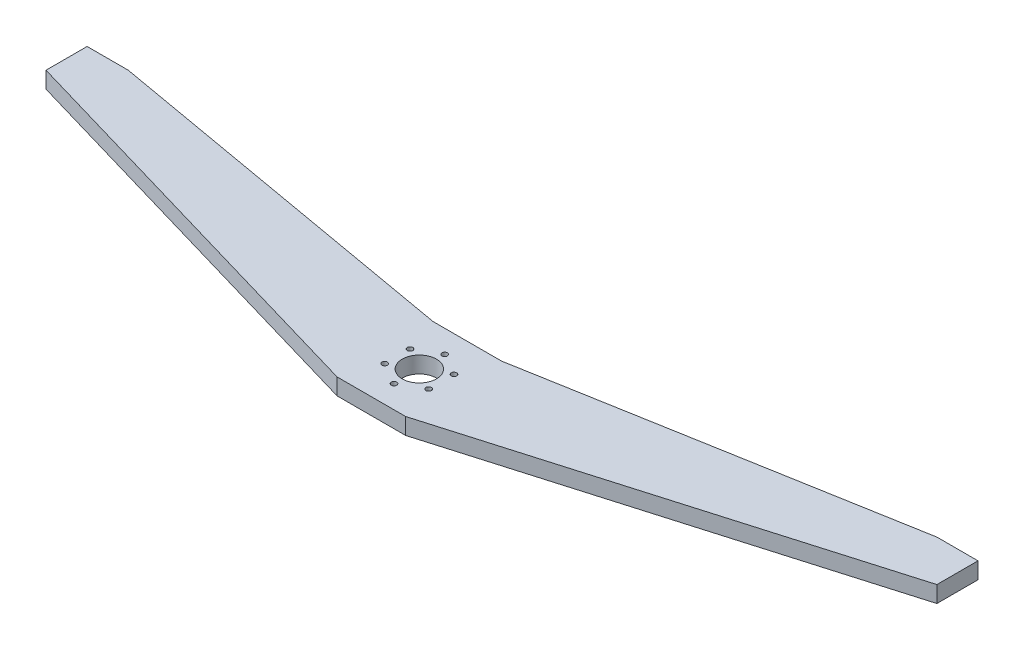
ISO-10303-21;
HEADER;
FILE_DESCRIPTION(('STEP AP214'),'2;1');
FILE_NAME('part.step','',(''),(''),'','','');
FILE_SCHEMA(('AUTOMOTIVE_DESIGN { 1 0 10303 214 1 1 1 1 }'));
ENDSEC;
DATA;
#1=APPLICATION_CONTEXT('core data for automotive mechanical design processes');
#2=APPLICATION_PROTOCOL_DEFINITION('international standard','automotive_design',2000,#1);
#3=PRODUCT_CONTEXT('',#1,'mechanical');
#4=PRODUCT('Part','Part','',(#3));
#5=PRODUCT_RELATED_PRODUCT_CATEGORY('part','',(#4));
#6=PRODUCT_DEFINITION_FORMATION('','',#4);
#7=PRODUCT_DEFINITION_CONTEXT('part definition',#1,'design');
#8=PRODUCT_DEFINITION('design','',#6,#7);
#9=PRODUCT_DEFINITION_SHAPE('','',#8);
#10=(LENGTH_UNIT() NAMED_UNIT(*) SI_UNIT(.MILLI.,.METRE.));
#11=(NAMED_UNIT(*) PLANE_ANGLE_UNIT() SI_UNIT($,.RADIAN.));
#12=(NAMED_UNIT(*) SI_UNIT($,.STERADIAN.) SOLID_ANGLE_UNIT());
#13=UNCERTAINTY_MEASURE_WITH_UNIT(LENGTH_MEASURE(1.E-05),#10,'distance_accuracy_value','');
#14=(GEOMETRIC_REPRESENTATION_CONTEXT(3) GLOBAL_UNCERTAINTY_ASSIGNED_CONTEXT((#13)) GLOBAL_UNIT_ASSIGNED_CONTEXT((#10,
#11,#12)) REPRESENTATION_CONTEXT('',''));
#15=CARTESIAN_POINT('',(0.,0.,0.));
#16=DIRECTION('',(0.,0.,1.));
#17=DIRECTION('',(1.,0.,0.));
#18=AXIS2_PLACEMENT_3D('',#15,#16,#17);
#19=CARTESIAN_POINT('',(-318.206861599198,12.,-87.6082847912839));
#20=DIRECTION('',(1.,0.,0.));
#21=DIRECTION('',(0.,0.,-1.));
#22=AXIS2_PLACEMENT_3D('',#19,#20,#21);
#23=PLANE('',#22);
#24=DIRECTION('',(0.,0.,1.));
#25=VECTOR('',#24,1.);
#26=CARTESIAN_POINT('',(-318.206861599198,0.,-87.6082847912839));
#27=LINE('',#26,#25);
#28=CARTESIAN_POINT('',(-318.206861599198,0.,-117.608284791284));
#29=VERTEX_POINT('',#28);
#30=CARTESIAN_POINT('',(-318.206861599198,0.,-87.6082847912839));
#31=VERTEX_POINT('',#30);
#32=EDGE_CURVE('E144',#29,#31,#27,.T.);
#33=ORIENTED_EDGE('',*,*,#32,.T.);
#34=DIRECTION('',(0.,-1.,0.));
#35=VECTOR('',#34,1.);
#36=CARTESIAN_POINT('',(-318.206861599198,12.,-87.6082847912839));
#37=LINE('',#36,#35);
#38=CARTESIAN_POINT('',(-318.206861599198,12.,-87.6082847912839));
#39=VERTEX_POINT('',#38);
#40=EDGE_CURVE('E11',#39,#31,#37,.T.);
#41=ORIENTED_EDGE('',*,*,#40,.F.);
#42=DIRECTION('',(0.,0.,1.));
#43=VECTOR('',#42,1.);
#44=CARTESIAN_POINT('',(-318.206861599198,12.,-87.6082847912839));
#45=LINE('',#44,#43);
#46=CARTESIAN_POINT('',(-318.206861599198,12.,-117.608284791284));
#47=VERTEX_POINT('',#46);
#48=EDGE_CURVE('E162',#47,#39,#45,.T.);
#49=ORIENTED_EDGE('',*,*,#48,.F.);
#50=DIRECTION('',(0.,-1.,0.));
#51=VECTOR('',#50,1.);
#52=CARTESIAN_POINT('',(-318.206861599198,12.,-117.608284791284));
#53=LINE('',#52,#51);
#54=EDGE_CURVE('E140',#47,#29,#53,.T.);
#55=ORIENTED_EDGE('',*,*,#54,.T.);
#56=EDGE_LOOP('',(#33,#41,#49,#55));
#57=FACE_BOUND('',#56,.T.);
#58=ADVANCED_FACE('F34',(#57),#23,.F.);
#59=CARTESIAN_POINT('',(-318.206861599198,12.,-87.6082847912839));
#60=DIRECTION('',(0.280319298356245,0.,-0.959906813690299));
#61=DIRECTION('',(-0.959906813690299,0.,-0.280319298356245));
#62=AXIS2_PLACEMENT_3D('',#59,#60,#61);
#63=PLANE('',#62);
#64=DIRECTION('',(0.959906813690299,0.,0.280319298356245));
#65=VECTOR('',#64,1.);
#66=CARTESIAN_POINT('',(-318.206861599198,0.,-87.6082847912839));
#67=LINE('',#66,#65);
#68=CARTESIAN_POINT('',(-18.2068615991978,0.,0.));
#69=VERTEX_POINT('',#68);
#70=EDGE_CURVE('E147',#31,#69,#67,.T.);
#71=ORIENTED_EDGE('',*,*,#70,.T.);
#72=DIRECTION('',(0.,-1.,0.));
#73=VECTOR('',#72,1.);
#74=CARTESIAN_POINT('',(-18.2068615991978,12.,0.));
#75=LINE('',#74,#73);
#76=CARTESIAN_POINT('',(-18.2068615991978,12.,0.));
#77=VERTEX_POINT('',#76);
#78=EDGE_CURVE('E43',#77,#69,#75,.T.);
#79=ORIENTED_EDGE('',*,*,#78,.F.);
#80=DIRECTION('',(0.959906813690299,0.,0.280319298356245));
#81=VECTOR('',#80,1.);
#82=CARTESIAN_POINT('',(-318.206861599198,12.,-87.6082847912839));
#83=LINE('',#82,#81);
#84=EDGE_CURVE('E101',#39,#77,#83,.T.);
#85=ORIENTED_EDGE('',*,*,#84,.F.);
#86=ORIENTED_EDGE('',*,*,#40,.T.);
#87=EDGE_LOOP('',(#71,#79,#85,#86));
#88=FACE_BOUND('',#87,.T.);
#89=ADVANCED_FACE('F237',(#88),#63,.F.);
#90=CARTESIAN_POINT('',(-18.2068615991978,12.,0.));
#91=DIRECTION('',(0.,0.,-1.));
#92=DIRECTION('',(-1.,0.,0.));
#93=AXIS2_PLACEMENT_3D('',#90,#91,#92);
#94=PLANE('',#93);
#95=DIRECTION('',(1.,0.,0.));
#96=VECTOR('',#95,1.);
#97=CARTESIAN_POINT('',(-18.2068615991978,0.,0.));
#98=LINE('',#97,#96);
#99=CARTESIAN_POINT('',(31.7931384008022,0.,0.));
#100=VERTEX_POINT('',#99);
#101=EDGE_CURVE('E149',#69,#100,#98,.T.);
#102=ORIENTED_EDGE('',*,*,#101,.T.);
#103=DIRECTION('',(0.,-1.,0.));
#104=VECTOR('',#103,1.);
#105=CARTESIAN_POINT('',(31.7931384008022,12.,0.));
#106=LINE('',#105,#104);
#107=CARTESIAN_POINT('',(31.7931384008022,12.,0.));
#108=VERTEX_POINT('',#107);
#109=EDGE_CURVE('E175',#108,#100,#106,.T.);
#110=ORIENTED_EDGE('',*,*,#109,.F.);
#111=DIRECTION('',(1.,0.,0.));
#112=VECTOR('',#111,1.);
#113=CARTESIAN_POINT('',(-18.2068615991978,12.,0.));
#114=LINE('',#113,#112);
#115=EDGE_CURVE('E379',#77,#108,#114,.T.);
#116=ORIENTED_EDGE('',*,*,#115,.F.);
#117=ORIENTED_EDGE('',*,*,#78,.T.);
#118=EDGE_LOOP('',(#102,#110,#116,#117));
#119=FACE_BOUND('',#118,.T.);
#120=ADVANCED_FACE('F241',(#119),#94,.F.);
#121=CARTESIAN_POINT('',(31.7931384008022,12.,0.));
#122=DIRECTION('',(-0.280319298356251,0.,-0.959906813690297));
#123=DIRECTION('',(-0.959906813690297,0.,0.280319298356251));
#124=AXIS2_PLACEMENT_3D('',#121,#122,#123);
#125=PLANE('',#124);
#126=DIRECTION('',(0.959906813690297,0.,-0.280319298356251));
#127=VECTOR('',#126,1.);
#128=CARTESIAN_POINT('',(31.7931384008022,0.,0.));
#129=LINE('',#128,#127);
#130=CARTESIAN_POINT('',(331.793138400802,0.,-87.6082847912857));
#131=VERTEX_POINT('',#130);
#132=EDGE_CURVE('E151',#100,#131,#129,.T.);
#133=ORIENTED_EDGE('',*,*,#132,.T.);
#134=DIRECTION('',(0.,-1.,0.));
#135=VECTOR('',#134,1.);
#136=CARTESIAN_POINT('',(331.793138400802,12.,-87.6082847912857));
#137=LINE('',#136,#135);
#138=CARTESIAN_POINT('',(331.793138400802,12.,-87.6082847912857));
#139=VERTEX_POINT('',#138);
#140=EDGE_CURVE('E172',#139,#131,#137,.T.);
#141=ORIENTED_EDGE('',*,*,#140,.F.);
#142=DIRECTION('',(0.959906813690297,0.,-0.280319298356251));
#143=VECTOR('',#142,1.);
#144=CARTESIAN_POINT('',(31.7931384008022,12.,0.));
#145=LINE('',#144,#143);
#146=EDGE_CURVE('E381',#108,#139,#145,.T.);
#147=ORIENTED_EDGE('',*,*,#146,.F.);
#148=ORIENTED_EDGE('',*,*,#109,.T.);
#149=EDGE_LOOP('',(#133,#141,#147,#148));
#150=FACE_BOUND('',#149,.T.);
#151=ADVANCED_FACE('F245',(#150),#125,.F.);
#152=CARTESIAN_POINT('',(331.793138400802,12.,-87.6082847912857));
#153=DIRECTION('',(-1.,0.,0.));
#154=DIRECTION('',(0.,0.,1.));
#155=AXIS2_PLACEMENT_3D('',#152,#153,#154);
#156=PLANE('',#155);
#157=DIRECTION('',(0.,0.,-1.));
#158=VECTOR('',#157,1.);
#159=CARTESIAN_POINT('',(331.793138400802,0.,-87.6082847912857));
#160=LINE('',#159,#158);
#161=CARTESIAN_POINT('',(331.793138400802,0.,-117.608284791286));
#162=VERTEX_POINT('',#161);
#163=EDGE_CURVE('E153',#131,#162,#160,.T.);
#164=ORIENTED_EDGE('',*,*,#163,.T.);
#165=DIRECTION('',(0.,-1.,0.));
#166=VECTOR('',#165,1.);
#167=CARTESIAN_POINT('',(331.793138400802,12.,-117.608284791286));
#168=LINE('',#167,#166);
#169=CARTESIAN_POINT('',(331.793138400802,12.,-117.608284791286));
#170=VERTEX_POINT('',#169);
#171=EDGE_CURVE('E169',#170,#162,#168,.T.);
#172=ORIENTED_EDGE('',*,*,#171,.F.);
#173=DIRECTION('',(0.,0.,-1.));
#174=VECTOR('',#173,1.);
#175=CARTESIAN_POINT('',(331.793138400802,12.,-87.6082847912857));
#176=LINE('',#175,#174);
#177=EDGE_CURVE('E383',#139,#170,#176,.T.);
#178=ORIENTED_EDGE('',*,*,#177,.F.);
#179=ORIENTED_EDGE('',*,*,#140,.T.);
#180=EDGE_LOOP('',(#164,#172,#178,#179));
#181=FACE_BOUND('',#180,.T.);
#182=ADVANCED_FACE('F251',(#181),#156,.F.);
#183=CARTESIAN_POINT('',(331.793138400802,12.,-117.608284791286));
#184=DIRECTION('',(0.,0.,1.));
#185=DIRECTION('',(1.,0.,0.));
#186=AXIS2_PLACEMENT_3D('',#183,#184,#185);
#187=PLANE('',#186);
#188=DIRECTION('',(-1.,0.,0.));
#189=VECTOR('',#188,1.);
#190=CARTESIAN_POINT('',(331.793138400802,0.,-117.608284791286));
#191=LINE('',#190,#189);
#192=CARTESIAN_POINT('',(301.793138400802,0.,-117.608284791286));
#193=VERTEX_POINT('',#192);
#194=EDGE_CURVE('E155',#162,#193,#191,.T.);
#195=ORIENTED_EDGE('',*,*,#194,.T.);
#196=DIRECTION('',(0.,-1.,0.));
#197=VECTOR('',#196,1.);
#198=CARTESIAN_POINT('',(301.793138400802,12.,-117.608284791286));
#199=LINE('',#198,#197);
#200=CARTESIAN_POINT('',(301.793138400802,12.,-117.608284791286));
#201=VERTEX_POINT('',#200);
#202=EDGE_CURVE('E166',#201,#193,#199,.T.);
#203=ORIENTED_EDGE('',*,*,#202,.F.);
#204=DIRECTION('',(-1.,0.,0.));
#205=VECTOR('',#204,1.);
#206=CARTESIAN_POINT('',(331.793138400802,12.,-117.608284791286));
#207=LINE('',#206,#205);
#208=EDGE_CURVE('E385',#170,#201,#207,.T.);
#209=ORIENTED_EDGE('',*,*,#208,.F.);
#210=ORIENTED_EDGE('',*,*,#171,.T.);
#211=EDGE_LOOP('',(#195,#203,#209,#210));
#212=FACE_BOUND('',#211,.T.);
#213=ADVANCED_FACE('F255',(#212),#187,.F.);
#214=CARTESIAN_POINT('',(301.793138400802,12.,-117.608284791286));
#215=DIRECTION('',(0.173648177666931,0.,0.984807753012208));
#216=DIRECTION('',(0.984807753012208,0.,-0.173648177666931));
#217=AXIS2_PLACEMENT_3D('',#214,#215,#216);
#218=PLANE('',#217);
#219=DIRECTION('',(-0.984807753012208,0.,0.173648177666931));
#220=VECTOR('',#219,1.);
#221=CARTESIAN_POINT('',(301.793138400802,0.,-117.608284791286));
#222=LINE('',#221,#220);
#223=CARTESIAN_POINT('',(31.7931384008021,0.,-70.));
#224=VERTEX_POINT('',#223);
#225=EDGE_CURVE('E157',#193,#224,#222,.T.);
#226=ORIENTED_EDGE('',*,*,#225,.T.);
#227=DIRECTION('',(0.,-1.,0.));
#228=VECTOR('',#227,1.);
#229=CARTESIAN_POINT('',(31.7931384008021,12.,-70.));
#230=LINE('',#229,#228);
#231=CARTESIAN_POINT('',(31.7931384008021,12.,-70.));
#232=VERTEX_POINT('',#231);
#233=EDGE_CURVE('E135',#232,#224,#230,.T.);
#234=ORIENTED_EDGE('',*,*,#233,.F.);
#235=DIRECTION('',(-0.984807753012208,0.,0.173648177666931));
#236=VECTOR('',#235,1.);
#237=CARTESIAN_POINT('',(301.793138400802,12.,-117.608284791286));
#238=LINE('',#237,#236);
#239=EDGE_CURVE('E126',#201,#232,#238,.T.);
#240=ORIENTED_EDGE('',*,*,#239,.F.);
#241=ORIENTED_EDGE('',*,*,#202,.T.);
#242=EDGE_LOOP('',(#226,#234,#240,#241));
#243=FACE_BOUND('',#242,.T.);
#244=ADVANCED_FACE('F259',(#243),#218,.F.);
#245=CARTESIAN_POINT('',(31.7931384008021,12.,-70.));
#246=DIRECTION('',(0.,0.,1.));
#247=DIRECTION('',(1.,0.,0.));
#248=AXIS2_PLACEMENT_3D('',#245,#246,#247);
#249=PLANE('',#248);
#250=DIRECTION('',(-1.,0.,0.));
#251=VECTOR('',#250,1.);
#252=CARTESIAN_POINT('',(31.7931384008021,0.,-70.));
#253=LINE('',#252,#251);
#254=CARTESIAN_POINT('',(-18.2068615991979,0.,-70.));
#255=VERTEX_POINT('',#254);
#256=EDGE_CURVE('E134',#224,#255,#253,.T.);
#257=ORIENTED_EDGE('',*,*,#256,.T.);
#258=DIRECTION('',(0.,-1.,0.));
#259=VECTOR('',#258,1.);
#260=CARTESIAN_POINT('',(-18.2068615991979,12.,-70.));
#261=LINE('',#260,#259);
#262=CARTESIAN_POINT('',(-18.2068615991979,12.,-70.));
#263=VERTEX_POINT('',#262);
#264=EDGE_CURVE('E131',#263,#255,#261,.T.);
#265=ORIENTED_EDGE('',*,*,#264,.F.);
#266=DIRECTION('',(-1.,0.,0.));
#267=VECTOR('',#266,1.);
#268=CARTESIAN_POINT('',(31.7931384008021,12.,-70.));
#269=LINE('',#268,#267);
#270=EDGE_CURVE('E120',#232,#263,#269,.T.);
#271=ORIENTED_EDGE('',*,*,#270,.F.);
#272=ORIENTED_EDGE('',*,*,#233,.T.);
#273=EDGE_LOOP('',(#257,#265,#271,#272));
#274=FACE_BOUND('',#273,.T.);
#275=ADVANCED_FACE('F132',(#274),#249,.F.);
#276=CARTESIAN_POINT('',(-288.206861599198,12.,-117.608284791284));
#277=DIRECTION('',(-0.173648177666924,0.,0.984807753012209));
#278=DIRECTION('',(0.984807753012209,0.,0.173648177666924));
#279=AXIS2_PLACEMENT_3D('',#276,#277,#278);
#280=PLANE('',#279);
#281=DIRECTION('',(-0.984807753012209,0.,-0.173648177666924));
#282=VECTOR('',#281,1.);
#283=CARTESIAN_POINT('',(-288.206861599198,0.,-117.608284791284));
#284=LINE('',#283,#282);
#285=CARTESIAN_POINT('',(-288.206861599198,0.,-117.608284791284));
#286=VERTEX_POINT('',#285);
#287=EDGE_CURVE('E87',#255,#286,#284,.T.);
#288=ORIENTED_EDGE('',*,*,#287,.T.);
#289=DIRECTION('',(0.,-1.,0.));
#290=VECTOR('',#289,1.);
#291=CARTESIAN_POINT('',(-288.206861599198,12.,-117.608284791284));
#292=LINE('',#291,#290);
#293=CARTESIAN_POINT('',(-288.206861599198,12.,-117.608284791284));
#294=VERTEX_POINT('',#293);
#295=EDGE_CURVE('E136',#294,#286,#292,.T.);
#296=ORIENTED_EDGE('',*,*,#295,.F.);
#297=DIRECTION('',(-0.984807753012209,0.,-0.173648177666924));
#298=VECTOR('',#297,1.);
#299=CARTESIAN_POINT('',(-288.206861599198,12.,-117.608284791284));
#300=LINE('',#299,#298);
#301=EDGE_CURVE('E124',#263,#294,#300,.T.);
#302=ORIENTED_EDGE('',*,*,#301,.F.);
#303=ORIENTED_EDGE('',*,*,#264,.T.);
#304=EDGE_LOOP('',(#288,#296,#302,#303));
#305=FACE_BOUND('',#304,.T.);
#306=ADVANCED_FACE('F138',(#305),#280,.F.);
#307=CARTESIAN_POINT('',(-318.206861599198,12.,-117.608284791284));
#308=DIRECTION('',(0.,0.,1.));
#309=DIRECTION('',(1.,0.,0.));
#310=AXIS2_PLACEMENT_3D('',#307,#308,#309);
#311=PLANE('',#310);
#312=DIRECTION('',(-1.,0.,0.));
#313=VECTOR('',#312,1.);
#314=CARTESIAN_POINT('',(-318.206861599198,0.,-117.608284791284));
#315=LINE('',#314,#313);
#316=EDGE_CURVE('E93',#286,#29,#315,.T.);
#317=ORIENTED_EDGE('',*,*,#316,.T.);
#318=ORIENTED_EDGE('',*,*,#54,.F.);
#319=DIRECTION('',(-1.,0.,0.));
#320=VECTOR('',#319,1.);
#321=CARTESIAN_POINT('',(-318.206861599198,12.,-117.608284791284));
#322=LINE('',#321,#320);
#323=EDGE_CURVE('E52',#294,#47,#322,.T.);
#324=ORIENTED_EDGE('',*,*,#323,.F.);
#325=ORIENTED_EDGE('',*,*,#295,.T.);
#326=EDGE_LOOP('',(#317,#318,#324,#325));
#327=FACE_BOUND('',#326,.T.);
#328=ADVANCED_FACE('F226',(#327),#311,.F.);
#329=CARTESIAN_POINT('',(0.,12.,0.));
#330=DIRECTION('',(0.,-1.,0.));
#331=DIRECTION('',(0.,0.,-1.));
#332=AXIS2_PLACEMENT_3D('',#329,#330,#331);
#333=PLANE('',#332);
#334=CARTESIAN_POINT('',(-9.22833156920977,12.,-44.2499999999998));
#335=DIRECTION('',(0.,1.,0.));
#336=DIRECTION('',(0.,0.,1.));
#337=AXIS2_PLACEMENT_3D('',#334,#335,#336);
#338=CIRCLE('',#337,2.);
#339=CARTESIAN_POINT('',(-9.22833156920977,12.,-42.2499999999998));
#340=VERTEX_POINT('',#339);
#341=EDGE_CURVE('E365',#340,#340,#338,.T.);
#342=ORIENTED_EDGE('',*,*,#341,.F.);
#343=EDGE_LOOP('',(#342));
#344=FACE_BOUND('',#343,.T.);
#345=CARTESIAN_POINT('',(-9.2283315692095,12.,-25.7499999999998));
#346=DIRECTION('',(0.,1.,0.));
#347=DIRECTION('',(0.,0.,1.));
#348=AXIS2_PLACEMENT_3D('',#345,#346,#347);
#349=CIRCLE('',#348,1.99999999999998);
#350=CARTESIAN_POINT('',(-9.2283315692095,12.,-23.7499999999998));
#351=VERTEX_POINT('',#350);
#352=EDGE_CURVE('E362',#351,#351,#349,.T.);
#353=ORIENTED_EDGE('',*,*,#352,.F.);
#354=EDGE_LOOP('',(#353));
#355=FACE_BOUND('',#354,.T.);
#356=CARTESIAN_POINT('',(6.79313840080276,12.,-16.5));
#357=DIRECTION('',(0.,1.,0.));
#358=DIRECTION('',(0.,0.,1.));
#359=AXIS2_PLACEMENT_3D('',#356,#357,#358);
#360=CIRCLE('',#359,1.99999999999994);
#361=CARTESIAN_POINT('',(6.79313840080276,12.,-14.5000000000001));
#362=VERTEX_POINT('',#361);
#363=EDGE_CURVE('E364',#362,#362,#360,.T.);
#364=ORIENTED_EDGE('',*,*,#363,.F.);
#365=EDGE_LOOP('',(#364));
#366=FACE_BOUND('',#365,.T.);
#367=CARTESIAN_POINT('',(22.8146083708147,12.,-25.7500000000002));
#368=DIRECTION('',(0.,1.,0.));
#369=DIRECTION('',(0.,0.,1.));
#370=AXIS2_PLACEMENT_3D('',#367,#368,#369);
#371=CIRCLE('',#370,1.99999999999989);
#372=CARTESIAN_POINT('',(22.8146083708147,12.,-23.7500000000003));
#373=VERTEX_POINT('',#372);
#374=EDGE_CURVE('E368',#373,#373,#371,.T.);
#375=ORIENTED_EDGE('',*,*,#374,.F.);
#376=EDGE_LOOP('',(#375));
#377=FACE_BOUND('',#376,.T.);
#378=CARTESIAN_POINT('',(22.8146083708145,12.,-44.2500000000002));
#379=DIRECTION('',(0.,1.,0.));
#380=DIRECTION('',(0.,0.,1.));
#381=AXIS2_PLACEMENT_3D('',#378,#379,#380);
#382=CIRCLE('',#381,2.00000000000001);
#383=CARTESIAN_POINT('',(22.8146083708145,12.,-42.2500000000002));
#384=VERTEX_POINT('',#383);
#385=EDGE_CURVE('E401',#384,#384,#382,.T.);
#386=ORIENTED_EDGE('',*,*,#385,.F.);
#387=EDGE_LOOP('',(#386));
#388=FACE_BOUND('',#387,.T.);
#389=CARTESIAN_POINT('',(6.79313840080222,12.,-53.5));
#390=DIRECTION('',(0.,1.,0.));
#391=DIRECTION('',(0.,0.,1.));
#392=AXIS2_PLACEMENT_3D('',#389,#390,#391);
#393=CIRCLE('',#392,2.);
#394=CARTESIAN_POINT('',(6.79313840080222,12.,-51.5));
#395=VERTEX_POINT('',#394);
#396=EDGE_CURVE('E376',#395,#395,#393,.T.);
#397=ORIENTED_EDGE('',*,*,#396,.F.);
#398=EDGE_LOOP('',(#397));
#399=FACE_BOUND('',#398,.T.);
#400=CARTESIAN_POINT('',(6.79313840080203,12.,-35.));
#401=DIRECTION('',(0.,1.,0.));
#402=DIRECTION('',(0.,0.,1.));
#403=AXIS2_PLACEMENT_3D('',#400,#401,#402);
#404=CIRCLE('',#403,12.5);
#405=CARTESIAN_POINT('',(6.79313840080203,12.,-22.5));
#406=VERTEX_POINT('',#405);
#407=EDGE_CURVE('E184',#406,#406,#404,.T.);
#408=ORIENTED_EDGE('',*,*,#407,.F.);
#409=EDGE_LOOP('',(#408));
#410=FACE_BOUND('',#409,.T.);
#411=ORIENTED_EDGE('',*,*,#48,.T.);
#412=ORIENTED_EDGE('',*,*,#84,.T.);
#413=ORIENTED_EDGE('',*,*,#115,.T.);
#414=ORIENTED_EDGE('',*,*,#146,.T.);
#415=ORIENTED_EDGE('',*,*,#177,.T.);
#416=ORIENTED_EDGE('',*,*,#208,.T.);
#417=ORIENTED_EDGE('',*,*,#239,.T.);
#418=ORIENTED_EDGE('',*,*,#270,.T.);
#419=ORIENTED_EDGE('',*,*,#301,.T.);
#420=ORIENTED_EDGE('',*,*,#323,.T.);
#421=EDGE_LOOP('',(#411,#412,#413,#414,#415,#416,#417,#418,#419,#420));
#422=FACE_BOUND('',#421,.T.);
#423=ADVANCED_FACE('F122',(#344,#355,#366,#377,#388,#399,#410,#422),#333,.F.);
#424=CARTESIAN_POINT('',(0.,0.,0.));
#425=DIRECTION('',(0.,-1.,0.));
#426=DIRECTION('',(0.,0.,-1.));
#427=AXIS2_PLACEMENT_3D('',#424,#425,#426);
#428=PLANE('',#427);
#429=CARTESIAN_POINT('',(-9.22833156920977,0.,-44.2499999999998));
#430=DIRECTION('',(0.,-1.,0.));
#431=DIRECTION('',(0.,0.,-1.));
#432=AXIS2_PLACEMENT_3D('',#429,#430,#431);
#433=CIRCLE('',#432,2.);
#434=CARTESIAN_POINT('',(-9.22833156920977,0.,-46.2499999999998));
#435=VERTEX_POINT('',#434);
#436=EDGE_CURVE('E37',#435,#435,#433,.T.);
#437=ORIENTED_EDGE('',*,*,#436,.F.);
#438=EDGE_LOOP('',(#437));
#439=FACE_BOUND('',#438,.T.);
#440=CARTESIAN_POINT('',(-9.2283315692095,0.,-25.7499999999998));
#441=DIRECTION('',(0.,-1.,0.));
#442=DIRECTION('',(0.,0.,-1.));
#443=AXIS2_PLACEMENT_3D('',#440,#441,#442);
#444=CIRCLE('',#443,1.99999999999998);
#445=CARTESIAN_POINT('',(-9.2283315692095,0.,-27.7499999999997));
#446=VERTEX_POINT('',#445);
#447=EDGE_CURVE('E195',#446,#446,#444,.T.);
#448=ORIENTED_EDGE('',*,*,#447,.F.);
#449=EDGE_LOOP('',(#448));
#450=FACE_BOUND('',#449,.T.);
#451=CARTESIAN_POINT('',(6.79313840080276,0.,-16.5));
#452=DIRECTION('',(0.,-1.,0.));
#453=DIRECTION('',(0.,0.,-1.));
#454=AXIS2_PLACEMENT_3D('',#451,#452,#453);
#455=CIRCLE('',#454,1.99999999999994);
#456=CARTESIAN_POINT('',(6.79313840080276,0.,-18.4999999999999));
#457=VERTEX_POINT('',#456);
#458=EDGE_CURVE('E193',#457,#457,#455,.T.);
#459=ORIENTED_EDGE('',*,*,#458,.F.);
#460=EDGE_LOOP('',(#459));
#461=FACE_BOUND('',#460,.T.);
#462=CARTESIAN_POINT('',(22.8146083708147,0.,-25.7500000000002));
#463=DIRECTION('',(0.,-1.,0.));
#464=DIRECTION('',(0.,0.,-1.));
#465=AXIS2_PLACEMENT_3D('',#462,#463,#464);
#466=CIRCLE('',#465,1.99999999999989);
#467=CARTESIAN_POINT('',(22.8146083708147,0.,-27.7500000000001));
#468=VERTEX_POINT('',#467);
#469=EDGE_CURVE('E190',#468,#468,#466,.T.);
#470=ORIENTED_EDGE('',*,*,#469,.F.);
#471=EDGE_LOOP('',(#470));
#472=FACE_BOUND('',#471,.T.);
#473=CARTESIAN_POINT('',(22.8146083708145,0.,-44.2500000000002));
#474=DIRECTION('',(0.,-1.,0.));
#475=DIRECTION('',(0.,0.,-1.));
#476=AXIS2_PLACEMENT_3D('',#473,#474,#475);
#477=CIRCLE('',#476,2.00000000000001);
#478=CARTESIAN_POINT('',(22.8146083708145,0.,-46.2500000000002));
#479=VERTEX_POINT('',#478);
#480=EDGE_CURVE('E187',#479,#479,#477,.T.);
#481=ORIENTED_EDGE('',*,*,#480,.F.);
#482=EDGE_LOOP('',(#481));
#483=FACE_BOUND('',#482,.T.);
#484=CARTESIAN_POINT('',(6.79313840080222,0.,-53.5));
#485=DIRECTION('',(0.,-1.,0.));
#486=DIRECTION('',(0.,0.,-1.));
#487=AXIS2_PLACEMENT_3D('',#484,#485,#486);
#488=CIRCLE('',#487,2.);
#489=CARTESIAN_POINT('',(6.79313840080222,0.,-55.5));
#490=VERTEX_POINT('',#489);
#491=EDGE_CURVE('E183',#490,#490,#488,.T.);
#492=ORIENTED_EDGE('',*,*,#491,.F.);
#493=EDGE_LOOP('',(#492));
#494=FACE_BOUND('',#493,.T.);
#495=CARTESIAN_POINT('',(6.79313840080203,0.,-35.));
#496=DIRECTION('',(0.,-1.,0.));
#497=DIRECTION('',(0.,0.,-1.));
#498=AXIS2_PLACEMENT_3D('',#495,#496,#497);
#499=CIRCLE('',#498,12.5);
#500=CARTESIAN_POINT('',(6.79313840080203,0.,-47.5));
#501=VERTEX_POINT('',#500);
#502=EDGE_CURVE('E180',#501,#501,#499,.T.);
#503=ORIENTED_EDGE('',*,*,#502,.F.);
#504=EDGE_LOOP('',(#503));
#505=FACE_BOUND('',#504,.T.);
#506=ORIENTED_EDGE('',*,*,#32,.F.);
#507=ORIENTED_EDGE('',*,*,#316,.F.);
#508=ORIENTED_EDGE('',*,*,#287,.F.);
#509=ORIENTED_EDGE('',*,*,#256,.F.);
#510=ORIENTED_EDGE('',*,*,#225,.F.);
#511=ORIENTED_EDGE('',*,*,#194,.F.);
#512=ORIENTED_EDGE('',*,*,#163,.F.);
#513=ORIENTED_EDGE('',*,*,#132,.F.);
#514=ORIENTED_EDGE('',*,*,#101,.F.);
#515=ORIENTED_EDGE('',*,*,#70,.F.);
#516=EDGE_LOOP('',(#506,#507,#508,#509,#510,#511,#512,#513,#514,#515));
#517=FACE_BOUND('',#516,.T.);
#518=ADVANCED_FACE('F205',(#439,#450,#461,#472,#483,#494,#505,#517),#428,.T.);
#519=CARTESIAN_POINT('',(6.79313840080203,-8.,-35.));
#520=DIRECTION('',(0.,1.,0.));
#521=DIRECTION('',(0.,0.,1.));
#522=AXIS2_PLACEMENT_3D('',#519,#520,#521);
#523=CYLINDRICAL_SURFACE('',#522,12.5);
#524=ORIENTED_EDGE('',*,*,#502,.T.);
#525=EDGE_LOOP('',(#524));
#526=FACE_BOUND('',#525,.T.);
#527=ORIENTED_EDGE('',*,*,#407,.T.);
#528=EDGE_LOOP('',(#527));
#529=FACE_BOUND('',#528,.T.);
#530=ADVANCED_FACE('F208',(#526,#529),#523,.F.);
#531=CARTESIAN_POINT('',(6.79313840080222,-8.,-53.5));
#532=DIRECTION('',(0.,1.,0.));
#533=DIRECTION('',(0.,0.,1.));
#534=AXIS2_PLACEMENT_3D('',#531,#532,#533);
#535=CYLINDRICAL_SURFACE('',#534,2.);
#536=ORIENTED_EDGE('',*,*,#491,.T.);
#537=EDGE_LOOP('',(#536));
#538=FACE_BOUND('',#537,.T.);
#539=ORIENTED_EDGE('',*,*,#396,.T.);
#540=EDGE_LOOP('',(#539));
#541=FACE_BOUND('',#540,.T.);
#542=ADVANCED_FACE('F298',(#538,#541),#535,.F.);
#543=CARTESIAN_POINT('',(22.8146083708145,-8.,-44.2500000000002));
#544=DIRECTION('',(0.,1.,0.));
#545=DIRECTION('',(0.,0.,1.));
#546=AXIS2_PLACEMENT_3D('',#543,#544,#545);
#547=CYLINDRICAL_SURFACE('',#546,2.00000000000001);
#548=ORIENTED_EDGE('',*,*,#480,.T.);
#549=EDGE_LOOP('',(#548));
#550=FACE_BOUND('',#549,.T.);
#551=ORIENTED_EDGE('',*,*,#385,.T.);
#552=EDGE_LOOP('',(#551));
#553=FACE_BOUND('',#552,.T.);
#554=ADVANCED_FACE('F308',(#550,#553),#547,.F.);
#555=CARTESIAN_POINT('',(22.8146083708147,-8.,-25.7500000000002));
#556=DIRECTION('',(0.,1.,0.));
#557=DIRECTION('',(0.,0.,1.));
#558=AXIS2_PLACEMENT_3D('',#555,#556,#557);
#559=CYLINDRICAL_SURFACE('',#558,1.99999999999989);
#560=ORIENTED_EDGE('',*,*,#469,.T.);
#561=EDGE_LOOP('',(#560));
#562=FACE_BOUND('',#561,.T.);
#563=ORIENTED_EDGE('',*,*,#374,.T.);
#564=EDGE_LOOP('',(#563));
#565=FACE_BOUND('',#564,.T.);
#566=ADVANCED_FACE('F318',(#562,#565),#559,.F.);
#567=CARTESIAN_POINT('',(6.79313840080276,-8.,-16.5));
#568=DIRECTION('',(0.,1.,0.));
#569=DIRECTION('',(0.,0.,1.));
#570=AXIS2_PLACEMENT_3D('',#567,#568,#569);
#571=CYLINDRICAL_SURFACE('',#570,1.99999999999994);
#572=ORIENTED_EDGE('',*,*,#458,.T.);
#573=EDGE_LOOP('',(#572));
#574=FACE_BOUND('',#573,.T.);
#575=ORIENTED_EDGE('',*,*,#363,.T.);
#576=EDGE_LOOP('',(#575));
#577=FACE_BOUND('',#576,.T.);
#578=ADVANCED_FACE('F328',(#574,#577),#571,.F.);
#579=CARTESIAN_POINT('',(-9.2283315692095,-8.,-25.7499999999998));
#580=DIRECTION('',(0.,1.,0.));
#581=DIRECTION('',(0.,0.,1.));
#582=AXIS2_PLACEMENT_3D('',#579,#580,#581);
#583=CYLINDRICAL_SURFACE('',#582,1.99999999999998);
#584=ORIENTED_EDGE('',*,*,#447,.T.);
#585=EDGE_LOOP('',(#584));
#586=FACE_BOUND('',#585,.T.);
#587=ORIENTED_EDGE('',*,*,#352,.T.);
#588=EDGE_LOOP('',(#587));
#589=FACE_BOUND('',#588,.T.);
#590=ADVANCED_FACE('F338',(#586,#589),#583,.F.);
#591=CARTESIAN_POINT('',(-9.22833156920977,-8.,-44.2499999999998));
#592=DIRECTION('',(0.,1.,0.));
#593=DIRECTION('',(0.,0.,1.));
#594=AXIS2_PLACEMENT_3D('',#591,#592,#593);
#595=CYLINDRICAL_SURFACE('',#594,2.);
#596=ORIENTED_EDGE('',*,*,#436,.T.);
#597=EDGE_LOOP('',(#596));
#598=FACE_BOUND('',#597,.T.);
#599=ORIENTED_EDGE('',*,*,#341,.T.);
#600=EDGE_LOOP('',(#599));
#601=FACE_BOUND('',#600,.T.);
#602=ADVANCED_FACE('F202',(#598,#601),#595,.F.);
#603=CLOSED_SHELL('',(#58,#89,#120,#151,#182,#213,#244,#275,#306,#328,#423,#518,#530,#542,#554,
#566,#578,#590,#602));
#604=MANIFOLD_SOLID_BREP('B2',#603);
#605=ADVANCED_BREP_SHAPE_REPRESENTATION('',(#18,#604),#14);
#606=SHAPE_DEFINITION_REPRESENTATION(#9,#605);
ENDSEC;
END-ISO-10303-21;
